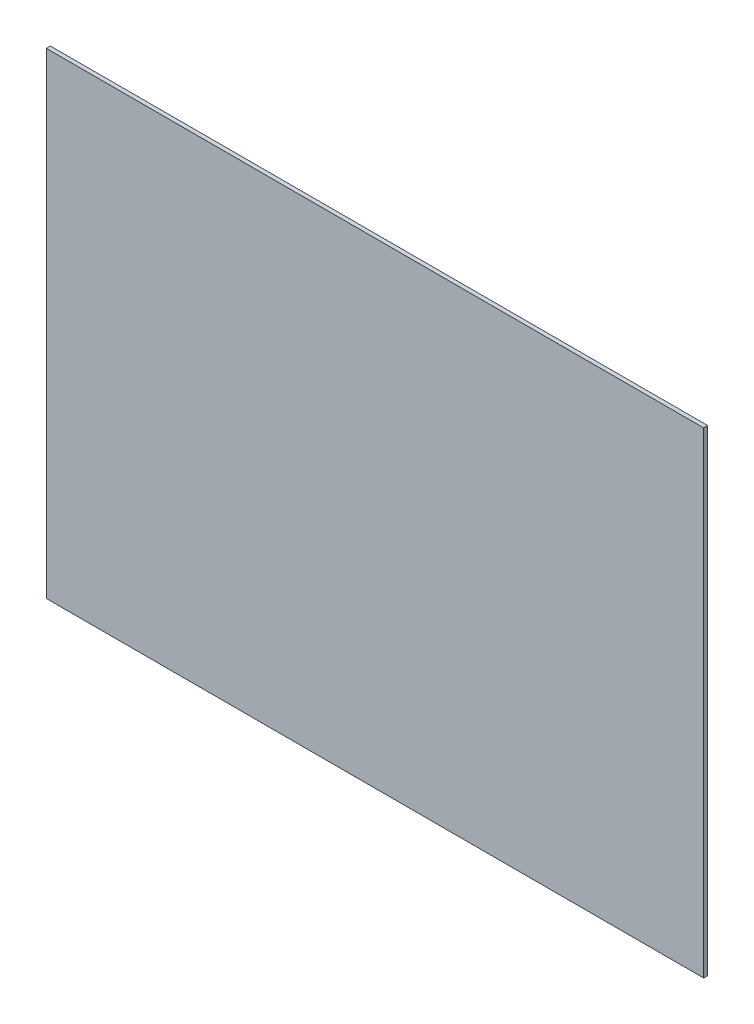
ISO-10303-21;
HEADER;
FILE_DESCRIPTION(('STEP AP214'),'2;1');
FILE_NAME('part.step','',(''),(''),'','','');
FILE_SCHEMA(('AUTOMOTIVE_DESIGN { 1 0 10303 214 1 1 1 1 }'));
ENDSEC;
DATA;
#1=APPLICATION_CONTEXT('core data for automotive mechanical design processes');
#2=APPLICATION_PROTOCOL_DEFINITION('international standard','automotive_design',2000,#1);
#3=PRODUCT_CONTEXT('',#1,'mechanical');
#4=PRODUCT('Part','Part','',(#3));
#5=PRODUCT_RELATED_PRODUCT_CATEGORY('part','',(#4));
#6=PRODUCT_DEFINITION_FORMATION('','',#4);
#7=PRODUCT_DEFINITION_CONTEXT('part definition',#1,'design');
#8=PRODUCT_DEFINITION('design','',#6,#7);
#9=PRODUCT_DEFINITION_SHAPE('','',#8);
#10=(LENGTH_UNIT() NAMED_UNIT(*) SI_UNIT(.MILLI.,.METRE.));
#11=(NAMED_UNIT(*) PLANE_ANGLE_UNIT() SI_UNIT($,.RADIAN.));
#12=(NAMED_UNIT(*) SI_UNIT($,.STERADIAN.) SOLID_ANGLE_UNIT());
#13=UNCERTAINTY_MEASURE_WITH_UNIT(LENGTH_MEASURE(1.E-05),#10,'distance_accuracy_value','');
#14=(GEOMETRIC_REPRESENTATION_CONTEXT(3) GLOBAL_UNCERTAINTY_ASSIGNED_CONTEXT((#13)) GLOBAL_UNIT_ASSIGNED_CONTEXT((#10,
#11,#12)) REPRESENTATION_CONTEXT('',''));
#15=CARTESIAN_POINT('',(0.,0.,0.));
#16=DIRECTION('',(0.,0.,1.));
#17=DIRECTION('',(1.,0.,0.));
#18=AXIS2_PLACEMENT_3D('',#15,#16,#17);
#19=CARTESIAN_POINT('',(454.599999999993,-329.500000000007,2.794));
#20=DIRECTION('',(-1.,0.,0.));
#21=DIRECTION('',(0.,0.,1.));
#22=AXIS2_PLACEMENT_3D('',#19,#20,#21);
#23=PLANE('',#22);
#24=DIRECTION('',(0.,1.,0.));
#25=VECTOR('',#24,1.);
#26=CARTESIAN_POINT('',(454.599999999993,-329.500000000007,-2.794));
#27=LINE('',#26,#25);
#28=CARTESIAN_POINT('',(454.599999999993,-329.500000000007,-2.794));
#29=VERTEX_POINT('',#28);
#30=CARTESIAN_POINT('',(454.599999999993,329.500000000007,-2.794));
#31=VERTEX_POINT('',#30);
#32=EDGE_CURVE('E102',#29,#31,#27,.T.);
#33=ORIENTED_EDGE('',*,*,#32,.T.);
#34=DIRECTION('',(0.,0.,-1.));
#35=VECTOR('',#34,1.);
#36=CARTESIAN_POINT('',(454.599999999993,329.500000000007,2.794));
#37=LINE('',#36,#35);
#38=CARTESIAN_POINT('',(454.599999999993,329.500000000007,2.794));
#39=VERTEX_POINT('',#38);
#40=EDGE_CURVE('E11',#39,#31,#37,.T.);
#41=ORIENTED_EDGE('',*,*,#40,.F.);
#42=DIRECTION('',(0.,1.,0.));
#43=VECTOR('',#42,1.);
#44=CARTESIAN_POINT('',(454.599999999993,-329.500000000007,2.794));
#45=LINE('',#44,#43);
#46=CARTESIAN_POINT('',(454.599999999993,-329.500000000007,2.794));
#47=VERTEX_POINT('',#46);
#48=EDGE_CURVE('E90',#47,#39,#45,.T.);
#49=ORIENTED_EDGE('',*,*,#48,.F.);
#50=DIRECTION('',(0.,0.,-1.));
#51=VECTOR('',#50,1.);
#52=CARTESIAN_POINT('',(454.599999999993,-329.500000000007,2.794));
#53=LINE('',#52,#51);
#54=EDGE_CURVE('E98',#47,#29,#53,.T.);
#55=ORIENTED_EDGE('',*,*,#54,.T.);
#56=EDGE_LOOP('',(#33,#41,#49,#55));
#57=FACE_BOUND('',#56,.T.);
#58=ADVANCED_FACE('F39',(#57),#23,.F.);
#59=CARTESIAN_POINT('',(-454.599999999993,329.500000000007,2.794));
#60=DIRECTION('',(0.,-1.,0.));
#61=DIRECTION('',(0.,0.,-1.));
#62=AXIS2_PLACEMENT_3D('',#59,#60,#61);
#63=PLANE('',#62);
#64=DIRECTION('',(-1.,0.,0.));
#65=VECTOR('',#64,1.);
#66=CARTESIAN_POINT('',(-454.599999999993,329.500000000007,-2.794));
#67=LINE('',#66,#65);
#68=CARTESIAN_POINT('',(-454.599999999993,329.500000000007,-2.794));
#69=VERTEX_POINT('',#68);
#70=EDGE_CURVE('E94',#31,#69,#67,.T.);
#71=ORIENTED_EDGE('',*,*,#70,.T.);
#72=DIRECTION('',(0.,0.,-1.));
#73=VECTOR('',#72,1.);
#74=CARTESIAN_POINT('',(-454.599999999993,329.500000000007,2.794));
#75=LINE('',#74,#73);
#76=CARTESIAN_POINT('',(-454.599999999993,329.500000000007,2.794));
#77=VERTEX_POINT('',#76);
#78=EDGE_CURVE('E47',#77,#69,#75,.T.);
#79=ORIENTED_EDGE('',*,*,#78,.F.);
#80=DIRECTION('',(-1.,0.,0.));
#81=VECTOR('',#80,1.);
#82=CARTESIAN_POINT('',(-454.599999999993,329.500000000007,2.794));
#83=LINE('',#82,#81);
#84=EDGE_CURVE('E85',#39,#77,#83,.T.);
#85=ORIENTED_EDGE('',*,*,#84,.F.);
#86=ORIENTED_EDGE('',*,*,#40,.T.);
#87=EDGE_LOOP('',(#71,#79,#85,#86));
#88=FACE_BOUND('',#87,.T.);
#89=ADVANCED_FACE('F93',(#88),#63,.F.);
#90=CARTESIAN_POINT('',(-454.599999999993,-329.500000000007,2.794));
#91=DIRECTION('',(1.,0.,0.));
#92=DIRECTION('',(0.,0.,-1.));
#93=AXIS2_PLACEMENT_3D('',#90,#91,#92);
#94=PLANE('',#93);
#95=DIRECTION('',(0.,-1.,0.));
#96=VECTOR('',#95,1.);
#97=CARTESIAN_POINT('',(-454.599999999993,-329.500000000007,-2.794));
#98=LINE('',#97,#96);
#99=CARTESIAN_POINT('',(-454.599999999993,-329.500000000007,-2.794));
#100=VERTEX_POINT('',#99);
#101=EDGE_CURVE('E72',#69,#100,#98,.T.);
#102=ORIENTED_EDGE('',*,*,#101,.T.);
#103=DIRECTION('',(0.,0.,-1.));
#104=VECTOR('',#103,1.);
#105=CARTESIAN_POINT('',(-454.599999999993,-329.500000000007,2.794));
#106=LINE('',#105,#104);
#107=CARTESIAN_POINT('',(-454.599999999993,-329.500000000007,2.794));
#108=VERTEX_POINT('',#107);
#109=EDGE_CURVE('E95',#108,#100,#106,.T.);
#110=ORIENTED_EDGE('',*,*,#109,.F.);
#111=DIRECTION('',(0.,-1.,0.));
#112=VECTOR('',#111,1.);
#113=CARTESIAN_POINT('',(-454.599999999993,-329.500000000007,2.794));
#114=LINE('',#113,#112);
#115=EDGE_CURVE('E88',#77,#108,#114,.T.);
#116=ORIENTED_EDGE('',*,*,#115,.F.);
#117=ORIENTED_EDGE('',*,*,#78,.T.);
#118=EDGE_LOOP('',(#102,#110,#116,#117));
#119=FACE_BOUND('',#118,.T.);
#120=ADVANCED_FACE('F96',(#119),#94,.F.);
#121=CARTESIAN_POINT('',(-454.599999999993,-329.500000000007,2.794));
#122=DIRECTION('',(0.,1.,0.));
#123=DIRECTION('',(0.,0.,1.));
#124=AXIS2_PLACEMENT_3D('',#121,#122,#123);
#125=PLANE('',#124);
#126=DIRECTION('',(1.,0.,0.));
#127=VECTOR('',#126,1.);
#128=CARTESIAN_POINT('',(-454.599999999993,-329.500000000007,-2.794));
#129=LINE('',#128,#127);
#130=EDGE_CURVE('E78',#100,#29,#129,.T.);
#131=ORIENTED_EDGE('',*,*,#130,.T.);
#132=ORIENTED_EDGE('',*,*,#54,.F.);
#133=DIRECTION('',(1.,0.,0.));
#134=VECTOR('',#133,1.);
#135=CARTESIAN_POINT('',(-454.599999999993,-329.500000000007,2.794));
#136=LINE('',#135,#134);
#137=EDGE_CURVE('E55',#108,#47,#136,.T.);
#138=ORIENTED_EDGE('',*,*,#137,.F.);
#139=ORIENTED_EDGE('',*,*,#109,.T.);
#140=EDGE_LOOP('',(#131,#132,#138,#139));
#141=FACE_BOUND('',#140,.T.);
#142=ADVANCED_FACE('F109',(#141),#125,.F.);
#143=CARTESIAN_POINT('',(0.,0.,2.794));
#144=DIRECTION('',(0.,0.,-1.));
#145=DIRECTION('',(-1.,0.,0.));
#146=AXIS2_PLACEMENT_3D('',#143,#144,#145);
#147=PLANE('',#146);
#148=ORIENTED_EDGE('',*,*,#48,.T.);
#149=ORIENTED_EDGE('',*,*,#84,.T.);
#150=ORIENTED_EDGE('',*,*,#115,.T.);
#151=ORIENTED_EDGE('',*,*,#137,.T.);
#152=EDGE_LOOP('',(#148,#149,#150,#151));
#153=FACE_BOUND('',#152,.T.);
#154=ADVANCED_FACE('F86',(#153),#147,.F.);
#155=CARTESIAN_POINT('',(0.,0.,-2.794));
#156=DIRECTION('',(0.,0.,-1.));
#157=DIRECTION('',(-1.,0.,0.));
#158=AXIS2_PLACEMENT_3D('',#155,#156,#157);
#159=PLANE('',#158);
#160=ORIENTED_EDGE('',*,*,#32,.F.);
#161=ORIENTED_EDGE('',*,*,#130,.F.);
#162=ORIENTED_EDGE('',*,*,#101,.F.);
#163=ORIENTED_EDGE('',*,*,#70,.F.);
#164=EDGE_LOOP('',(#160,#161,#162,#163));
#165=FACE_BOUND('',#164,.T.);
#166=ADVANCED_FACE('F112',(#165),#159,.T.);
#167=CLOSED_SHELL('',(#58,#89,#120,#142,#154,#166));
#168=MANIFOLD_SOLID_BREP('B2',#167);
#169=ADVANCED_BREP_SHAPE_REPRESENTATION('',(#18,#168),#14);
#170=SHAPE_DEFINITION_REPRESENTATION(#9,#169);
ENDSEC;
END-ISO-10303-21;
